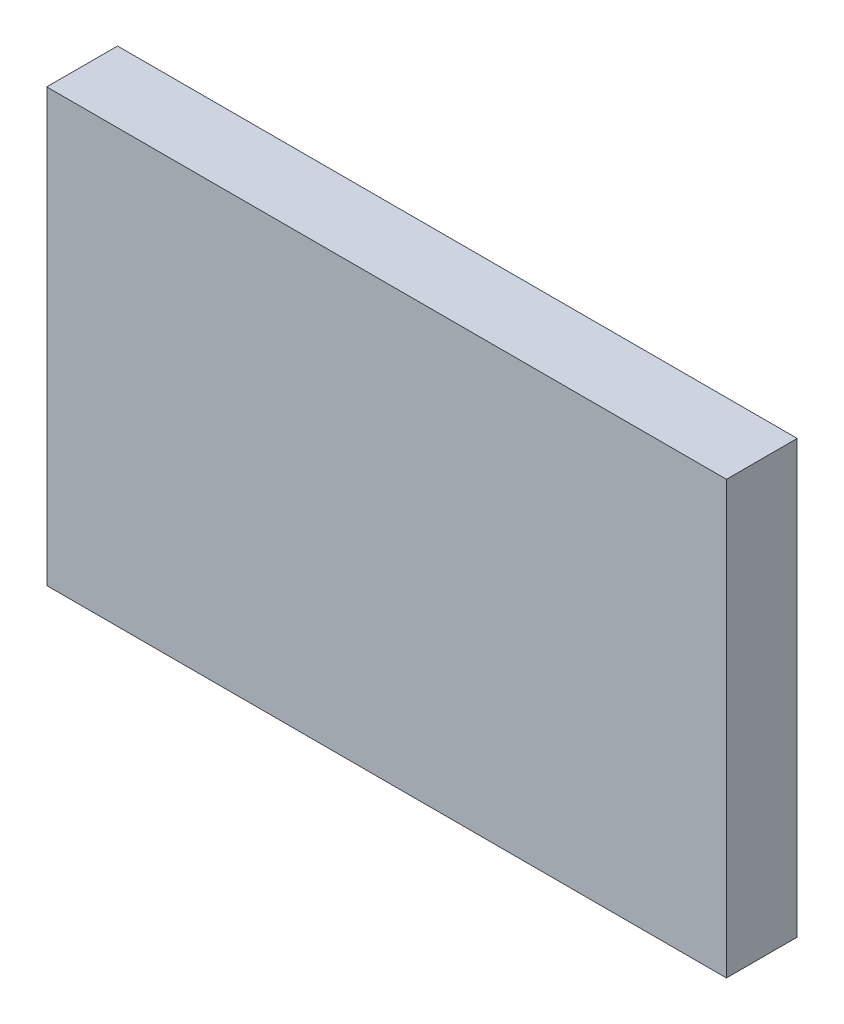
ISO-10303-21;
HEADER;
FILE_DESCRIPTION(('STEP AP214'),'2;1');
FILE_NAME('part.step','',(''),(''),'','','');
FILE_SCHEMA(('AUTOMOTIVE_DESIGN { 1 0 10303 214 1 1 1 1 }'));
ENDSEC;
DATA;
#1=APPLICATION_CONTEXT('core data for automotive mechanical design processes');
#2=APPLICATION_PROTOCOL_DEFINITION('international standard','automotive_design',2000,#1);
#3=PRODUCT_CONTEXT('',#1,'mechanical');
#4=PRODUCT('Part','Part','',(#3));
#5=PRODUCT_RELATED_PRODUCT_CATEGORY('part','',(#4));
#6=PRODUCT_DEFINITION_FORMATION('','',#4);
#7=PRODUCT_DEFINITION_CONTEXT('part definition',#1,'design');
#8=PRODUCT_DEFINITION('design','',#6,#7);
#9=PRODUCT_DEFINITION_SHAPE('','',#8);
#10=(LENGTH_UNIT() NAMED_UNIT(*) SI_UNIT(.MILLI.,.METRE.));
#11=(NAMED_UNIT(*) PLANE_ANGLE_UNIT() SI_UNIT($,.RADIAN.));
#12=(NAMED_UNIT(*) SI_UNIT($,.STERADIAN.) SOLID_ANGLE_UNIT());
#13=UNCERTAINTY_MEASURE_WITH_UNIT(LENGTH_MEASURE(1.E-05),#10,'distance_accuracy_value','');
#14=(GEOMETRIC_REPRESENTATION_CONTEXT(3) GLOBAL_UNCERTAINTY_ASSIGNED_CONTEXT((#13)) GLOBAL_UNIT_ASSIGNED_CONTEXT((#10,
#11,#12)) REPRESENTATION_CONTEXT('',''));
#15=CARTESIAN_POINT('',(0.,0.,0.));
#16=DIRECTION('',(0.,0.,1.));
#17=DIRECTION('',(1.,0.,0.));
#18=AXIS2_PLACEMENT_3D('',#15,#16,#17);
#19=CARTESIAN_POINT('',(0.,0.,-30.));
#20=DIRECTION('',(-1.,0.,0.));
#21=DIRECTION('',(0.,-1.,0.));
#22=AXIS2_PLACEMENT_3D('',#19,#20,#21);
#23=PLANE('',#22);
#24=DIRECTION('',(0.,0.,1.));
#25=VECTOR('',#24,1.);
#26=CARTESIAN_POINT('',(0.,-11.,-30.));
#27=LINE('',#26,#25);
#28=CARTESIAN_POINT('',(0.,-11.,-30.));
#29=VERTEX_POINT('',#28);
#30=CARTESIAN_POINT('',(0.,-11.,0.));
#31=VERTEX_POINT('',#30);
#32=EDGE_CURVE('E79',#29,#31,#27,.T.);
#33=ORIENTED_EDGE('',*,*,#32,.F.);
#34=DIRECTION('',(0.,-1.,0.));
#35=VECTOR('',#34,1.);
#36=CARTESIAN_POINT('',(0.,0.,-30.));
#37=LINE('',#36,#35);
#38=CARTESIAN_POINT('',(0.,-194.,-30.));
#39=VERTEX_POINT('',#38);
#40=EDGE_CURVE('E61',#29,#39,#37,.T.);
#41=ORIENTED_EDGE('',*,*,#40,.T.);
#42=DIRECTION('',(0.,0.,1.));
#43=VECTOR('',#42,1.);
#44=CARTESIAN_POINT('',(0.,-194.,-30.));
#45=LINE('',#44,#43);
#46=CARTESIAN_POINT('',(0.,-194.,0.));
#47=VERTEX_POINT('',#46);
#48=EDGE_CURVE('E45',#39,#47,#45,.T.);
#49=ORIENTED_EDGE('',*,*,#48,.T.);
#50=DIRECTION('',(0.,-1.,0.));
#51=VECTOR('',#50,1.);
#52=CARTESIAN_POINT('',(0.,0.,0.));
#53=LINE('',#52,#51);
#54=EDGE_CURVE('E85',#31,#47,#53,.T.);
#55=ORIENTED_EDGE('',*,*,#54,.F.);
#56=EDGE_LOOP('',(#33,#41,#49,#55));
#57=FACE_BOUND('',#56,.T.);
#58=ADVANCED_FACE('F38',(#57),#23,.T.);
#59=CARTESIAN_POINT('',(0.,-194.,-30.));
#60=DIRECTION('',(0.,-1.,0.));
#61=DIRECTION('',(0.,0.,-1.));
#62=AXIS2_PLACEMENT_3D('',#59,#60,#61);
#63=PLANE('',#62);
#64=DIRECTION('',(0.,0.,1.));
#65=VECTOR('',#64,1.);
#66=CARTESIAN_POINT('',(288.,-194.,-30.));
#67=LINE('',#66,#65);
#68=CARTESIAN_POINT('',(288.,-194.,-30.));
#69=VERTEX_POINT('',#68);
#70=CARTESIAN_POINT('',(288.,-194.,0.));
#71=VERTEX_POINT('',#70);
#72=EDGE_CURVE('E97',#69,#71,#67,.T.);
#73=ORIENTED_EDGE('',*,*,#72,.T.);
#74=DIRECTION('',(1.,0.,0.));
#75=VECTOR('',#74,1.);
#76=CARTESIAN_POINT('',(0.,-194.,0.));
#77=LINE('',#76,#75);
#78=EDGE_CURVE('E91',#47,#71,#77,.T.);
#79=ORIENTED_EDGE('',*,*,#78,.F.);
#80=ORIENTED_EDGE('',*,*,#48,.F.);
#81=DIRECTION('',(1.,0.,0.));
#82=VECTOR('',#81,1.);
#83=CARTESIAN_POINT('',(0.,-194.,-30.));
#84=LINE('',#83,#82);
#85=EDGE_CURVE('E90',#39,#69,#84,.T.);
#86=ORIENTED_EDGE('',*,*,#85,.T.);
#87=EDGE_LOOP('',(#73,#79,#80,#86));
#88=FACE_BOUND('',#87,.T.);
#89=ADVANCED_FACE('F103',(#88),#63,.T.);
#90=CARTESIAN_POINT('',(0.,0.,-30.));
#91=DIRECTION('',(0.,0.,1.));
#92=DIRECTION('',(1.,0.,0.));
#93=AXIS2_PLACEMENT_3D('',#90,#91,#92);
#94=PLANE('',#93);
#95=ORIENTED_EDGE('',*,*,#40,.F.);
#96=DIRECTION('',(1.,0.,0.));
#97=VECTOR('',#96,1.);
#98=CARTESIAN_POINT('',(0.,-11.,-30.));
#99=LINE('',#98,#97);
#100=CARTESIAN_POINT('',(288.,-11.,-30.));
#101=VERTEX_POINT('',#100);
#102=EDGE_CURVE('E77',#29,#101,#99,.T.);
#103=ORIENTED_EDGE('',*,*,#102,.T.);
#104=DIRECTION('',(0.,-1.,0.));
#105=VECTOR('',#104,1.);
#106=CARTESIAN_POINT('',(288.,0.,-30.));
#107=LINE('',#106,#105);
#108=EDGE_CURVE('E108',#101,#69,#107,.T.);
#109=ORIENTED_EDGE('',*,*,#108,.T.);
#110=ORIENTED_EDGE('',*,*,#85,.F.);
#111=EDGE_LOOP('',(#95,#103,#109,#110));
#112=FACE_BOUND('',#111,.T.);
#113=ADVANCED_FACE('F88',(#112),#94,.F.);
#114=CARTESIAN_POINT('',(0.,0.,0.));
#115=DIRECTION('',(0.,0.,1.));
#116=DIRECTION('',(1.,0.,0.));
#117=AXIS2_PLACEMENT_3D('',#114,#115,#116);
#118=PLANE('',#117);
#119=DIRECTION('',(1.,0.,0.));
#120=VECTOR('',#119,1.);
#121=CARTESIAN_POINT('',(0.,-11.,0.));
#122=LINE('',#121,#120);
#123=CARTESIAN_POINT('',(288.,-11.,0.));
#124=VERTEX_POINT('',#123);
#125=EDGE_CURVE('E52',#31,#124,#122,.T.);
#126=ORIENTED_EDGE('',*,*,#125,.F.);
#127=ORIENTED_EDGE('',*,*,#54,.T.);
#128=ORIENTED_EDGE('',*,*,#78,.T.);
#129=DIRECTION('',(0.,-1.,0.));
#130=VECTOR('',#129,1.);
#131=CARTESIAN_POINT('',(288.,0.,0.));
#132=LINE('',#131,#130);
#133=EDGE_CURVE('E11',#124,#71,#132,.T.);
#134=ORIENTED_EDGE('',*,*,#133,.F.);
#135=EDGE_LOOP('',(#126,#127,#128,#134));
#136=FACE_BOUND('',#135,.T.);
#137=ADVANCED_FACE('F107',(#136),#118,.T.);
#138=CARTESIAN_POINT('',(288.,0.,-30.));
#139=DIRECTION('',(-1.,0.,0.));
#140=DIRECTION('',(0.,0.,1.));
#141=AXIS2_PLACEMENT_3D('',#138,#139,#140);
#142=PLANE('',#141);
#143=ORIENTED_EDGE('',*,*,#108,.F.);
#144=DIRECTION('',(0.,0.,1.));
#145=VECTOR('',#144,1.);
#146=CARTESIAN_POINT('',(288.,-11.,-30.));
#147=LINE('',#146,#145);
#148=EDGE_CURVE('E80',#101,#124,#147,.T.);
#149=ORIENTED_EDGE('',*,*,#148,.T.);
#150=ORIENTED_EDGE('',*,*,#133,.T.);
#151=ORIENTED_EDGE('',*,*,#72,.F.);
#152=EDGE_LOOP('',(#143,#149,#150,#151));
#153=FACE_BOUND('',#152,.T.);
#154=ADVANCED_FACE('F112',(#153),#142,.F.);
#155=CARTESIAN_POINT('',(0.,-11.,-30.));
#156=DIRECTION('',(0.,-1.,0.));
#157=DIRECTION('',(0.,0.,-1.));
#158=AXIS2_PLACEMENT_3D('',#155,#156,#157);
#159=PLANE('',#158);
#160=ORIENTED_EDGE('',*,*,#125,.T.);
#161=ORIENTED_EDGE('',*,*,#148,.F.);
#162=ORIENTED_EDGE('',*,*,#102,.F.);
#163=ORIENTED_EDGE('',*,*,#32,.T.);
#164=EDGE_LOOP('',(#160,#161,#162,#163));
#165=FACE_BOUND('',#164,.T.);
#166=ADVANCED_FACE('F78',(#165),#159,.F.);
#167=CLOSED_SHELL('',(#58,#89,#113,#137,#154,#166));
#168=MANIFOLD_SOLID_BREP('B2',#167);
#169=ADVANCED_BREP_SHAPE_REPRESENTATION('',(#18,#168),#14);
#170=SHAPE_DEFINITION_REPRESENTATION(#9,#169);
ENDSEC;
END-ISO-10303-21;
